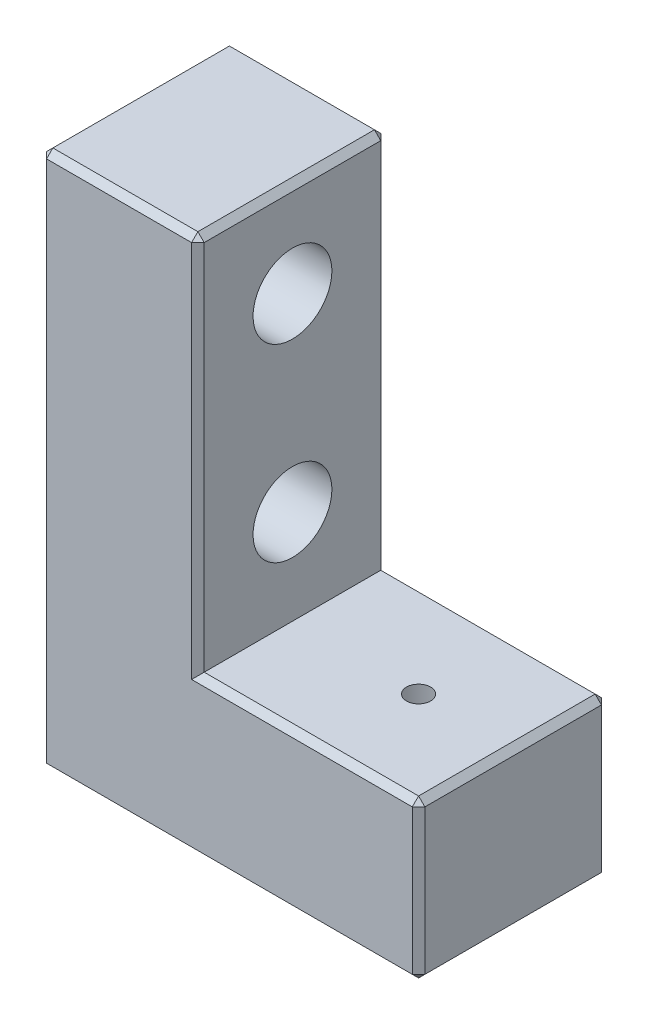
ISO-10303-21;
HEADER;
FILE_DESCRIPTION(('STEP AP214'),'2;1');
FILE_NAME('part.step','',(''),(''),'','','');
FILE_SCHEMA(('AUTOMOTIVE_DESIGN { 1 0 10303 214 1 1 1 1 }'));
ENDSEC;
DATA;
#1=APPLICATION_CONTEXT('core data for automotive mechanical design processes');
#2=APPLICATION_PROTOCOL_DEFINITION('international standard','automotive_design',2000,#1);
#3=PRODUCT_CONTEXT('',#1,'mechanical');
#4=PRODUCT('Part','Part','',(#3));
#5=PRODUCT_RELATED_PRODUCT_CATEGORY('part','',(#4));
#6=PRODUCT_DEFINITION_FORMATION('','',#4);
#7=PRODUCT_DEFINITION_CONTEXT('part definition',#1,'design');
#8=PRODUCT_DEFINITION('design','',#6,#7);
#9=PRODUCT_DEFINITION_SHAPE('','',#8);
#10=(LENGTH_UNIT() NAMED_UNIT(*) SI_UNIT(.MILLI.,.METRE.));
#11=(NAMED_UNIT(*) PLANE_ANGLE_UNIT() SI_UNIT($,.RADIAN.));
#12=(NAMED_UNIT(*) SI_UNIT($,.STERADIAN.) SOLID_ANGLE_UNIT());
#13=UNCERTAINTY_MEASURE_WITH_UNIT(LENGTH_MEASURE(1.E-05),#10,'distance_accuracy_value','');
#14=(GEOMETRIC_REPRESENTATION_CONTEXT(3) GLOBAL_UNCERTAINTY_ASSIGNED_CONTEXT((#13)) GLOBAL_UNIT_ASSIGNED_CONTEXT((#10,
#11,#12)) REPRESENTATION_CONTEXT('',''));
#15=CARTESIAN_POINT('',(0.,0.,0.));
#16=DIRECTION('',(0.,0.,1.));
#17=DIRECTION('',(1.,0.,0.));
#18=AXIS2_PLACEMENT_3D('',#15,#16,#17);
#19=CARTESIAN_POINT('',(5.,17.,3.));
#20=DIRECTION('',(0.,-1.,0.));
#21=DIRECTION('',(0.,0.,-1.));
#22=AXIS2_PLACEMENT_3D('',#19,#20,#21);
#23=PLANE('',#22);
#24=DIRECTION('',(0.,0.,-1.));
#25=VECTOR('',#24,1.);
#26=CARTESIAN_POINT('',(4.8,17.,3.));
#27=LINE('',#26,#25);
#28=CARTESIAN_POINT('',(4.8,17.,2.8));
#29=VERTEX_POINT('',#28);
#30=CARTESIAN_POINT('',(4.8,17.,-2.8));
#31=VERTEX_POINT('',#30);
#32=EDGE_CURVE('E210',#29,#31,#27,.T.);
#33=ORIENTED_EDGE('',*,*,#32,.T.);
#34=DIRECTION('',(-1.,0.,0.));
#35=VECTOR('',#34,1.);
#36=CARTESIAN_POINT('',(5.,17.,-2.8));
#37=LINE('',#36,#35);
#38=CARTESIAN_POINT('',(0.200000000000001,17.,-2.8));
#39=VERTEX_POINT('',#38);
#40=EDGE_CURVE('E213',#31,#39,#37,.T.);
#41=ORIENTED_EDGE('',*,*,#40,.T.);
#42=DIRECTION('',(0.,0.,1.));
#43=VECTOR('',#42,1.);
#44=CARTESIAN_POINT('',(0.200000000000001,17.,3.));
#45=LINE('',#44,#43);
#46=CARTESIAN_POINT('',(0.200000000000001,17.,2.8));
#47=VERTEX_POINT('',#46);
#48=EDGE_CURVE('E208',#39,#47,#45,.T.);
#49=ORIENTED_EDGE('',*,*,#48,.T.);
#50=DIRECTION('',(1.,0.,0.));
#51=VECTOR('',#50,1.);
#52=CARTESIAN_POINT('',(5.,17.,2.8));
#53=LINE('',#52,#51);
#54=EDGE_CURVE('E204',#47,#29,#53,.T.);
#55=ORIENTED_EDGE('',*,*,#54,.T.);
#56=EDGE_LOOP('',(#33,#41,#49,#55));
#57=FACE_BOUND('',#56,.T.);
#58=ADVANCED_FACE('F38',(#57),#23,.F.);
#59=CARTESIAN_POINT('',(0.,17.,3.));
#60=DIRECTION('',(1.,0.,0.));
#61=DIRECTION('',(0.,1.,0.));
#62=AXIS2_PLACEMENT_3D('',#59,#60,#61);
#63=PLANE('',#62);
#64=CARTESIAN_POINT('',(0.,8.,0.));
#65=DIRECTION('',(1.,0.,0.));
#66=DIRECTION('',(0.,1.,0.));
#67=AXIS2_PLACEMENT_3D('',#64,#65,#66);
#68=CIRCLE('',#67,1.25);
#69=CARTESIAN_POINT('',(0.,9.25,0.));
#70=VERTEX_POINT('',#69);
#71=EDGE_CURVE('E192',#70,#70,#68,.T.);
#72=ORIENTED_EDGE('',*,*,#71,.T.);
#73=EDGE_LOOP('',(#72));
#74=FACE_BOUND('',#73,.T.);
#75=CARTESIAN_POINT('',(0.,14.,0.));
#76=DIRECTION('',(1.,0.,0.));
#77=DIRECTION('',(0.,1.,0.));
#78=AXIS2_PLACEMENT_3D('',#75,#76,#77);
#79=CIRCLE('',#78,1.25);
#80=CARTESIAN_POINT('',(0.,15.25,0.));
#81=VERTEX_POINT('',#80);
#82=EDGE_CURVE('E198',#81,#81,#79,.T.);
#83=ORIENTED_EDGE('',*,*,#82,.T.);
#84=EDGE_LOOP('',(#83));
#85=FACE_BOUND('',#84,.T.);
#86=DIRECTION('',(0.,-1.,0.));
#87=VECTOR('',#86,1.);
#88=CARTESIAN_POINT('',(0.,17.,-2.8));
#89=LINE('',#88,#87);
#90=CARTESIAN_POINT('',(0.,16.8,-2.8));
#91=VERTEX_POINT('',#90);
#92=CARTESIAN_POINT('',(0.,0.199999999999999,-2.8));
#93=VERTEX_POINT('',#92);
#94=EDGE_CURVE('E227',#91,#93,#89,.T.);
#95=ORIENTED_EDGE('',*,*,#94,.T.);
#96=DIRECTION('',(0.,0.,1.));
#97=VECTOR('',#96,1.);
#98=CARTESIAN_POINT('',(0.,0.199999999999999,3.));
#99=LINE('',#98,#97);
#100=CARTESIAN_POINT('',(0.,0.200000000000003,2.8));
#101=VERTEX_POINT('',#100);
#102=EDGE_CURVE('E60',#93,#101,#99,.T.);
#103=ORIENTED_EDGE('',*,*,#102,.T.);
#104=DIRECTION('',(0.,1.,0.));
#105=VECTOR('',#104,1.);
#106=CARTESIAN_POINT('',(0.,17.,2.8));
#107=LINE('',#106,#105);
#108=CARTESIAN_POINT('',(0.,16.8,2.8));
#109=VERTEX_POINT('',#108);
#110=EDGE_CURVE('E222',#101,#109,#107,.T.);
#111=ORIENTED_EDGE('',*,*,#110,.T.);
#112=DIRECTION('',(0.,0.,-1.));
#113=VECTOR('',#112,1.);
#114=CARTESIAN_POINT('',(0.,16.8,3.));
#115=LINE('',#114,#113);
#116=EDGE_CURVE('E224',#109,#91,#115,.T.);
#117=ORIENTED_EDGE('',*,*,#116,.T.);
#118=EDGE_LOOP('',(#95,#103,#111,#117));
#119=FACE_BOUND('',#118,.T.);
#120=ADVANCED_FACE('F368',(#74,#85,#119),#63,.F.);
#121=CARTESIAN_POINT('',(0.,0.,3.));
#122=DIRECTION('',(0.,1.,0.));
#123=DIRECTION('',(0.,0.,1.));
#124=AXIS2_PLACEMENT_3D('',#121,#122,#123);
#125=PLANE('',#124);
#126=CARTESIAN_POINT('',(3.,0.,0.));
#127=DIRECTION('',(0.,-1.,0.));
#128=DIRECTION('',(0.,0.,-1.));
#129=AXIS2_PLACEMENT_3D('',#126,#127,#128);
#130=CIRCLE('',#129,1.25);
#131=CARTESIAN_POINT('',(3.,0.,-1.25));
#132=VERTEX_POINT('',#131);
#133=EDGE_CURVE('E183',#132,#132,#130,.T.);
#134=ORIENTED_EDGE('',*,*,#133,.F.);
#135=EDGE_LOOP('',(#134));
#136=FACE_BOUND('',#135,.T.);
#137=CARTESIAN_POINT('',(9.,0.,0.));
#138=DIRECTION('',(0.,-1.,0.));
#139=DIRECTION('',(0.,0.,-1.));
#140=AXIS2_PLACEMENT_3D('',#137,#138,#139);
#141=CIRCLE('',#140,1.25);
#142=CARTESIAN_POINT('',(9.,0.,-1.25));
#143=VERTEX_POINT('',#142);
#144=EDGE_CURVE('E186',#143,#143,#141,.T.);
#145=ORIENTED_EDGE('',*,*,#144,.F.);
#146=EDGE_LOOP('',(#145));
#147=FACE_BOUND('',#146,.T.);
#148=DIRECTION('',(-1.,0.,0.));
#149=VECTOR('',#148,1.);
#150=CARTESIAN_POINT('',(0.,0.,2.8));
#151=LINE('',#150,#149);
#152=CARTESIAN_POINT('',(11.8,0.,2.8));
#153=VERTEX_POINT('',#152);
#154=CARTESIAN_POINT('',(0.200000000000001,0.,2.8));
#155=VERTEX_POINT('',#154);
#156=EDGE_CURVE('E238',#153,#155,#151,.T.);
#157=ORIENTED_EDGE('',*,*,#156,.T.);
#158=DIRECTION('',(0.,0.,-1.));
#159=VECTOR('',#158,1.);
#160=CARTESIAN_POINT('',(0.200000000000001,0.,3.));
#161=LINE('',#160,#159);
#162=CARTESIAN_POINT('',(0.2,0.,-2.8));
#163=VERTEX_POINT('',#162);
#164=EDGE_CURVE('E278',#155,#163,#161,.T.);
#165=ORIENTED_EDGE('',*,*,#164,.T.);
#166=DIRECTION('',(1.,0.,0.));
#167=VECTOR('',#166,1.);
#168=CARTESIAN_POINT('',(0.,0.,-2.8));
#169=LINE('',#168,#167);
#170=CARTESIAN_POINT('',(11.8,0.,-2.8));
#171=VERTEX_POINT('',#170);
#172=EDGE_CURVE('E243',#163,#171,#169,.T.);
#173=ORIENTED_EDGE('',*,*,#172,.T.);
#174=DIRECTION('',(0.,0.,1.));
#175=VECTOR('',#174,1.);
#176=CARTESIAN_POINT('',(11.8,0.,3.));
#177=LINE('',#176,#175);
#178=EDGE_CURVE('E241',#171,#153,#177,.T.);
#179=ORIENTED_EDGE('',*,*,#178,.T.);
#180=EDGE_LOOP('',(#157,#165,#173,#179));
#181=FACE_BOUND('',#180,.T.);
#182=ADVANCED_FACE('F377',(#136,#147,#181),#125,.F.);
#183=CARTESIAN_POINT('',(12.,0.,3.));
#184=DIRECTION('',(-1.,0.,0.));
#185=DIRECTION('',(0.,0.,1.));
#186=AXIS2_PLACEMENT_3D('',#183,#184,#185);
#187=PLANE('',#186);
#188=DIRECTION('',(0.,-1.,0.));
#189=VECTOR('',#188,1.);
#190=CARTESIAN_POINT('',(12.,0.,2.8));
#191=LINE('',#190,#189);
#192=CARTESIAN_POINT('',(12.,4.8,2.8));
#193=VERTEX_POINT('',#192);
#194=CARTESIAN_POINT('',(12.,0.199999999999999,2.8));
#195=VERTEX_POINT('',#194);
#196=EDGE_CURVE('E229',#193,#195,#191,.T.);
#197=ORIENTED_EDGE('',*,*,#196,.T.);
#198=DIRECTION('',(0.,0.,-1.));
#199=VECTOR('',#198,1.);
#200=CARTESIAN_POINT('',(12.,0.199999999999999,3.));
#201=LINE('',#200,#199);
#202=CARTESIAN_POINT('',(12.,0.199999999999999,-2.8));
#203=VERTEX_POINT('',#202);
#204=EDGE_CURVE('E235',#195,#203,#201,.T.);
#205=ORIENTED_EDGE('',*,*,#204,.T.);
#206=DIRECTION('',(0.,1.,0.));
#207=VECTOR('',#206,1.);
#208=CARTESIAN_POINT('',(12.,0.,-2.8));
#209=LINE('',#208,#207);
#210=CARTESIAN_POINT('',(12.,4.8,-2.8));
#211=VERTEX_POINT('',#210);
#212=EDGE_CURVE('E233',#203,#211,#209,.T.);
#213=ORIENTED_EDGE('',*,*,#212,.T.);
#214=DIRECTION('',(0.,0.,1.));
#215=VECTOR('',#214,1.);
#216=CARTESIAN_POINT('',(12.,4.8,3.));
#217=LINE('',#216,#215);
#218=EDGE_CURVE('E231',#211,#193,#217,.T.);
#219=ORIENTED_EDGE('',*,*,#218,.T.);
#220=EDGE_LOOP('',(#197,#205,#213,#219));
#221=FACE_BOUND('',#220,.T.);
#222=ADVANCED_FACE('F448',(#221),#187,.F.);
#223=CARTESIAN_POINT('',(12.,5.,3.));
#224=DIRECTION('',(0.,-1.,0.));
#225=DIRECTION('',(1.,0.,0.));
#226=AXIS2_PLACEMENT_3D('',#223,#224,#225);
#227=PLANE('',#226);
#228=CARTESIAN_POINT('',(9.,5.,0.));
#229=DIRECTION('',(0.,-1.,0.));
#230=DIRECTION('',(1.,0.,0.));
#231=AXIS2_PLACEMENT_3D('',#228,#229,#230);
#232=CIRCLE('',#231,0.383974596215563);
#233=CARTESIAN_POINT('',(9.38397459621556,5.,0.));
#234=VERTEX_POINT('',#233);
#235=EDGE_CURVE('E177',#234,#234,#232,.T.);
#236=ORIENTED_EDGE('',*,*,#235,.T.);
#237=EDGE_LOOP('',(#236));
#238=FACE_BOUND('',#237,.T.);
#239=DIRECTION('',(0.,0.,-1.));
#240=VECTOR('',#239,1.);
#241=CARTESIAN_POINT('',(11.8,5.,3.));
#242=LINE('',#241,#240);
#243=CARTESIAN_POINT('',(11.8,5.,2.8));
#244=VERTEX_POINT('',#243);
#245=CARTESIAN_POINT('',(11.8,5.,-2.8));
#246=VERTEX_POINT('',#245);
#247=EDGE_CURVE('E260',#244,#246,#242,.T.);
#248=ORIENTED_EDGE('',*,*,#247,.T.);
#249=DIRECTION('',(-1.,0.,0.));
#250=VECTOR('',#249,1.);
#251=CARTESIAN_POINT('',(12.,5.,-2.8));
#252=LINE('',#251,#250);
#253=CARTESIAN_POINT('',(5.,5.,-2.8));
#254=VERTEX_POINT('',#253);
#255=EDGE_CURVE('E262',#246,#254,#252,.T.);
#256=ORIENTED_EDGE('',*,*,#255,.T.);
#257=DIRECTION('',(0.,0.,-1.));
#258=VECTOR('',#257,1.);
#259=CARTESIAN_POINT('',(5.,5.,3.));
#260=LINE('',#259,#258);
#261=CARTESIAN_POINT('',(5.,5.,2.8));
#262=VERTEX_POINT('',#261);
#263=EDGE_CURVE('E201',#262,#254,#260,.T.);
#264=ORIENTED_EDGE('',*,*,#263,.F.);
#265=DIRECTION('',(1.,0.,0.));
#266=VECTOR('',#265,1.);
#267=CARTESIAN_POINT('',(12.,5.,2.8));
#268=LINE('',#267,#266);
#269=EDGE_CURVE('E258',#262,#244,#268,.T.);
#270=ORIENTED_EDGE('',*,*,#269,.T.);
#271=EDGE_LOOP('',(#248,#256,#264,#270));
#272=FACE_BOUND('',#271,.T.);
#273=ADVANCED_FACE('F492',(#238,#272),#227,.F.);
#274=CARTESIAN_POINT('',(5.,5.,3.));
#275=DIRECTION('',(-1.,0.,0.));
#276=DIRECTION('',(0.,0.,1.));
#277=AXIS2_PLACEMENT_3D('',#274,#275,#276);
#278=PLANE('',#277);
#279=CARTESIAN_POINT('',(5.,8.,0.));
#280=DIRECTION('',(1.,0.,0.));
#281=DIRECTION('',(0.,1.,0.));
#282=AXIS2_PLACEMENT_3D('',#279,#280,#281);
#283=CIRCLE('',#282,1.25);
#284=CARTESIAN_POINT('',(5.,9.25,0.));
#285=VERTEX_POINT('',#284);
#286=EDGE_CURVE('E189',#285,#285,#283,.T.);
#287=ORIENTED_EDGE('',*,*,#286,.F.);
#288=EDGE_LOOP('',(#287));
#289=FACE_BOUND('',#288,.T.);
#290=CARTESIAN_POINT('',(5.,14.,0.));
#291=DIRECTION('',(1.,0.,0.));
#292=DIRECTION('',(0.,1.,0.));
#293=AXIS2_PLACEMENT_3D('',#290,#291,#292);
#294=CIRCLE('',#293,1.25);
#295=CARTESIAN_POINT('',(5.,15.25,0.));
#296=VERTEX_POINT('',#295);
#297=EDGE_CURVE('E195',#296,#296,#294,.T.);
#298=ORIENTED_EDGE('',*,*,#297,.F.);
#299=EDGE_LOOP('',(#298));
#300=FACE_BOUND('',#299,.T.);
#301=ORIENTED_EDGE('',*,*,#263,.T.);
#302=DIRECTION('',(0.,1.,0.));
#303=VECTOR('',#302,1.);
#304=CARTESIAN_POINT('',(5.,5.,-2.8));
#305=LINE('',#304,#303);
#306=CARTESIAN_POINT('',(5.,16.8,-2.8));
#307=VERTEX_POINT('',#306);
#308=EDGE_CURVE('E220',#254,#307,#305,.T.);
#309=ORIENTED_EDGE('',*,*,#308,.T.);
#310=DIRECTION('',(0.,0.,1.));
#311=VECTOR('',#310,1.);
#312=CARTESIAN_POINT('',(5.,16.8,3.));
#313=LINE('',#312,#311);
#314=CARTESIAN_POINT('',(5.,16.8,2.8));
#315=VERTEX_POINT('',#314);
#316=EDGE_CURVE('E217',#307,#315,#313,.T.);
#317=ORIENTED_EDGE('',*,*,#316,.T.);
#318=DIRECTION('',(0.,-1.,0.));
#319=VECTOR('',#318,1.);
#320=CARTESIAN_POINT('',(5.,5.,2.8));
#321=LINE('',#320,#319);
#322=EDGE_CURVE('E215',#315,#262,#321,.T.);
#323=ORIENTED_EDGE('',*,*,#322,.T.);
#324=EDGE_LOOP('',(#301,#309,#317,#323));
#325=FACE_BOUND('',#324,.T.);
#326=ADVANCED_FACE('F495',(#289,#300,#325),#278,.F.);
#327=CARTESIAN_POINT('',(0.,0.,3.));
#328=DIRECTION('',(0.,0.,1.));
#329=DIRECTION('',(1.,0.,0.));
#330=AXIS2_PLACEMENT_3D('',#327,#328,#329);
#331=PLANE('',#330);
#332=DIRECTION('',(-1.,0.,0.));
#333=VECTOR('',#332,1.);
#334=CARTESIAN_POINT('',(5.,4.8,3.));
#335=LINE('',#334,#333);
#336=CARTESIAN_POINT('',(11.8,4.8,3.));
#337=VERTEX_POINT('',#336);
#338=CARTESIAN_POINT('',(4.8,4.8,3.));
#339=VERTEX_POINT('',#338);
#340=EDGE_CURVE('E273',#337,#339,#335,.T.);
#341=ORIENTED_EDGE('',*,*,#340,.T.);
#342=DIRECTION('',(0.,1.,0.));
#343=VECTOR('',#342,1.);
#344=CARTESIAN_POINT('',(4.8,17.,3.));
#345=LINE('',#344,#343);
#346=CARTESIAN_POINT('',(4.8,16.8,3.));
#347=VERTEX_POINT('',#346);
#348=EDGE_CURVE('E275',#339,#347,#345,.T.);
#349=ORIENTED_EDGE('',*,*,#348,.T.);
#350=DIRECTION('',(-1.,0.,0.));
#351=VECTOR('',#350,1.);
#352=CARTESIAN_POINT('',(0.,16.8,3.));
#353=LINE('',#352,#351);
#354=CARTESIAN_POINT('',(0.199999999999999,16.8,3.));
#355=VERTEX_POINT('',#354);
#356=EDGE_CURVE('E264',#347,#355,#353,.T.);
#357=ORIENTED_EDGE('',*,*,#356,.T.);
#358=DIRECTION('',(0.,-1.,0.));
#359=VECTOR('',#358,1.);
#360=CARTESIAN_POINT('',(0.199999999999999,0.,3.));
#361=LINE('',#360,#359);
#362=CARTESIAN_POINT('',(0.199999999999999,0.199999999999999,3.));
#363=VERTEX_POINT('',#362);
#364=EDGE_CURVE('E266',#355,#363,#361,.T.);
#365=ORIENTED_EDGE('',*,*,#364,.T.);
#366=DIRECTION('',(1.,0.,0.));
#367=VECTOR('',#366,1.);
#368=CARTESIAN_POINT('',(12.,0.199999999999999,3.));
#369=LINE('',#368,#367);
#370=CARTESIAN_POINT('',(11.8,0.199999999999999,3.));
#371=VERTEX_POINT('',#370);
#372=EDGE_CURVE('E269',#363,#371,#369,.T.);
#373=ORIENTED_EDGE('',*,*,#372,.T.);
#374=DIRECTION('',(0.,1.,0.));
#375=VECTOR('',#374,1.);
#376=CARTESIAN_POINT('',(11.8,5.,3.));
#377=LINE('',#376,#375);
#378=EDGE_CURVE('E271',#371,#337,#377,.T.);
#379=ORIENTED_EDGE('',*,*,#378,.T.);
#380=EDGE_LOOP('',(#341,#349,#357,#365,#373,#379));
#381=FACE_BOUND('',#380,.T.);
#382=ADVANCED_FACE('F390',(#381),#331,.T.);
#383=CARTESIAN_POINT('',(0.,0.,-3.));
#384=DIRECTION('',(0.,0.,1.));
#385=DIRECTION('',(1.,0.,0.));
#386=AXIS2_PLACEMENT_3D('',#383,#384,#385);
#387=PLANE('',#386);
#388=DIRECTION('',(-1.,0.,0.));
#389=VECTOR('',#388,1.);
#390=CARTESIAN_POINT('',(0.,0.200000000000001,-3.));
#391=LINE('',#390,#389);
#392=CARTESIAN_POINT('',(11.8,0.200000000000001,-3.));
#393=VERTEX_POINT('',#392);
#394=CARTESIAN_POINT('',(0.200000000000001,0.200000000000001,-3.));
#395=VERTEX_POINT('',#394);
#396=EDGE_CURVE('E253',#393,#395,#391,.T.);
#397=ORIENTED_EDGE('',*,*,#396,.T.);
#398=DIRECTION('',(0.,1.,0.));
#399=VECTOR('',#398,1.);
#400=CARTESIAN_POINT('',(0.200000000000001,0.,-3.));
#401=LINE('',#400,#399);
#402=CARTESIAN_POINT('',(0.200000000000001,16.8,-3.));
#403=VERTEX_POINT('',#402);
#404=EDGE_CURVE('E255',#395,#403,#401,.T.);
#405=ORIENTED_EDGE('',*,*,#404,.T.);
#406=DIRECTION('',(1.,0.,0.));
#407=VECTOR('',#406,1.);
#408=CARTESIAN_POINT('',(0.,16.8,-3.));
#409=LINE('',#408,#407);
#410=CARTESIAN_POINT('',(4.8,16.8,-3.));
#411=VERTEX_POINT('',#410);
#412=EDGE_CURVE('E249',#403,#411,#409,.T.);
#413=ORIENTED_EDGE('',*,*,#412,.T.);
#414=DIRECTION('',(0.,-1.,0.));
#415=VECTOR('',#414,1.);
#416=CARTESIAN_POINT('',(4.8,0.,-3.));
#417=LINE('',#416,#415);
#418=CARTESIAN_POINT('',(4.8,4.8,-3.));
#419=VERTEX_POINT('',#418);
#420=EDGE_CURVE('E247',#411,#419,#417,.T.);
#421=ORIENTED_EDGE('',*,*,#420,.T.);
#422=DIRECTION('',(1.,0.,0.));
#423=VECTOR('',#422,1.);
#424=CARTESIAN_POINT('',(0.,4.8,-3.));
#425=LINE('',#424,#423);
#426=CARTESIAN_POINT('',(11.8,4.8,-3.));
#427=VERTEX_POINT('',#426);
#428=EDGE_CURVE('E245',#419,#427,#425,.T.);
#429=ORIENTED_EDGE('',*,*,#428,.T.);
#430=DIRECTION('',(0.,-1.,0.));
#431=VECTOR('',#430,1.);
#432=CARTESIAN_POINT('',(11.8,0.,-3.));
#433=LINE('',#432,#431);
#434=EDGE_CURVE('E251',#427,#393,#433,.T.);
#435=ORIENTED_EDGE('',*,*,#434,.T.);
#436=EDGE_LOOP('',(#397,#405,#413,#421,#429,#435));
#437=FACE_BOUND('',#436,.T.);
#438=ADVANCED_FACE('F420',(#437),#387,.F.);
#439=CARTESIAN_POINT('',(-0.999999999999998,14.,0.));
#440=DIRECTION('',(1.,0.,0.));
#441=DIRECTION('',(0.,1.,0.));
#442=AXIS2_PLACEMENT_3D('',#439,#440,#441);
#443=CYLINDRICAL_SURFACE('',#442,1.25);
#444=ORIENTED_EDGE('',*,*,#297,.T.);
#445=EDGE_LOOP('',(#444));
#446=FACE_BOUND('',#445,.T.);
#447=ORIENTED_EDGE('',*,*,#82,.F.);
#448=EDGE_LOOP('',(#447));
#449=FACE_BOUND('',#448,.T.);
#450=ADVANCED_FACE('F502',(#446,#449),#443,.F.);
#451=CARTESIAN_POINT('',(-0.999999999999998,8.,0.));
#452=DIRECTION('',(1.,0.,0.));
#453=DIRECTION('',(0.,1.,0.));
#454=AXIS2_PLACEMENT_3D('',#451,#452,#453);
#455=CYLINDRICAL_SURFACE('',#454,1.25);
#456=ORIENTED_EDGE('',*,*,#286,.T.);
#457=EDGE_LOOP('',(#456));
#458=FACE_BOUND('',#457,.T.);
#459=ORIENTED_EDGE('',*,*,#71,.F.);
#460=EDGE_LOOP('',(#459));
#461=FACE_BOUND('',#460,.T.);
#462=ADVANCED_FACE('F507',(#458,#461),#455,.F.);
#463=CARTESIAN_POINT('',(9.,3.,0.));
#464=DIRECTION('',(0.,-1.,0.));
#465=DIRECTION('',(0.,0.,-1.));
#466=AXIS2_PLACEMENT_3D('',#463,#464,#465);
#467=CYLINDRICAL_SURFACE('',#466,1.25);
#468=ORIENTED_EDGE('',*,*,#144,.T.);
#469=EDGE_LOOP('',(#468));
#470=FACE_BOUND('',#469,.T.);
#471=CARTESIAN_POINT('',(9.,4.5,0.));
#472=DIRECTION('',(0.,-1.,0.));
#473=DIRECTION('',(0.,0.,-1.));
#474=AXIS2_PLACEMENT_3D('',#471,#472,#473);
#475=CIRCLE('',#474,1.25);
#476=CARTESIAN_POINT('',(9.,4.5,-1.25));
#477=VERTEX_POINT('',#476);
#478=EDGE_CURVE('E173',#477,#477,#475,.T.);
#479=ORIENTED_EDGE('',*,*,#478,.F.);
#480=EDGE_LOOP('',(#479));
#481=FACE_BOUND('',#480,.T.);
#482=ADVANCED_FACE('F511',(#470,#481),#467,.F.);
#483=CARTESIAN_POINT('',(3.,3.,0.));
#484=DIRECTION('',(0.,-1.,0.));
#485=DIRECTION('',(0.,0.,-1.));
#486=AXIS2_PLACEMENT_3D('',#483,#484,#485);
#487=CYLINDRICAL_SURFACE('',#486,1.25);
#488=ORIENTED_EDGE('',*,*,#133,.T.);
#489=EDGE_LOOP('',(#488));
#490=FACE_BOUND('',#489,.T.);
#491=CARTESIAN_POINT('',(3.,4.5,0.));
#492=DIRECTION('',(0.,-1.,0.));
#493=DIRECTION('',(0.,0.,-1.));
#494=AXIS2_PLACEMENT_3D('',#491,#492,#493);
#495=CIRCLE('',#494,1.25);
#496=CARTESIAN_POINT('',(3.,4.5,-1.25));
#497=VERTEX_POINT('',#496);
#498=EDGE_CURVE('E171',#497,#497,#495,.T.);
#499=ORIENTED_EDGE('',*,*,#498,.F.);
#500=EDGE_LOOP('',(#499));
#501=FACE_BOUND('',#500,.T.);
#502=ADVANCED_FACE('F515',(#490,#501),#487,.F.);
#503=CARTESIAN_POINT('',(9.,4.5,0.));
#504=DIRECTION('',(0.,-1.,0.));
#505=DIRECTION('',(0.,0.,-1.));
#506=AXIS2_PLACEMENT_3D('',#503,#504,#505);
#507=CONICAL_SURFACE('',#506,1.25,1.0471975511966);
#508=ORIENTED_EDGE('',*,*,#478,.T.);
#509=EDGE_LOOP('',(#508));
#510=FACE_BOUND('',#509,.T.);
#511=ORIENTED_EDGE('',*,*,#235,.F.);
#512=EDGE_LOOP('',(#511));
#513=FACE_BOUND('',#512,.T.);
#514=ADVANCED_FACE('F167',(#510,#513),#507,.F.);
#515=CARTESIAN_POINT('',(3.,4.5,0.));
#516=DIRECTION('',(0.,-1.,0.));
#517=DIRECTION('',(0.,0.,-1.));
#518=AXIS2_PLACEMENT_3D('',#515,#516,#517);
#519=CONICAL_SURFACE('',#518,1.25,1.0471975511966);
#520=CARTESIAN_POINT('',(3.,5.22168783648703,0.));
#521=VERTEX_POINT('',#520);
#522=VERTEX_LOOP('',#521);
#523=FACE_BOUND('',#522,.T.);
#524=ORIENTED_EDGE('',*,*,#498,.T.);
#525=EDGE_LOOP('',(#524));
#526=FACE_BOUND('',#525,.T.);
#527=ADVANCED_FACE('F163',(#523,#526),#519,.F.);
#528=CARTESIAN_POINT('',(12.,0.199999999999999,3.));
#529=DIRECTION('',(-0.707106781186544,0.707106781186551,0.));
#530=DIRECTION('',(0.,0.,-1.));
#531=AXIS2_PLACEMENT_3D('',#528,#529,#530);
#532=PLANE('',#531);
#533=DIRECTION('',(-0.707106781186551,-0.707106781186544,0.));
#534=VECTOR('',#533,1.);
#535=CARTESIAN_POINT('',(11.8,0.,2.8));
#536=LINE('',#535,#534);
#537=EDGE_CURVE('E174',#153,#195,#536,.F.);
#538=ORIENTED_EDGE('',*,*,#537,.F.);
#539=ORIENTED_EDGE('',*,*,#178,.F.);
#540=DIRECTION('',(0.707106781186551,0.707106781186544,0.));
#541=VECTOR('',#540,1.);
#542=CARTESIAN_POINT('',(12.,0.199999999999999,-2.8));
#543=LINE('',#542,#541);
#544=EDGE_CURVE('E180',#203,#171,#543,.F.);
#545=ORIENTED_EDGE('',*,*,#544,.F.);
#546=ORIENTED_EDGE('',*,*,#204,.F.);
#547=EDGE_LOOP('',(#538,#539,#545,#546));
#548=FACE_BOUND('',#547,.T.);
#549=ADVANCED_FACE('F166',(#548),#532,.F.);
#550=CARTESIAN_POINT('',(11.8,0.,2.8));
#551=DIRECTION('',(0.577350269189626,-0.577350269189631,0.577350269189621));
#552=DIRECTION('',(0.70710678118655,0.707106781186544,0.));
#553=AXIS2_PLACEMENT_3D('',#550,#551,#552);
#554=PLANE('',#553);
#555=DIRECTION('',(0.,-0.707106781186544,-0.707106781186551));
#556=VECTOR('',#555,1.);
#557=CARTESIAN_POINT('',(11.8,0.,2.8));
#558=LINE('',#557,#556);
#559=EDGE_CURVE('E346',#153,#371,#558,.F.);
#560=ORIENTED_EDGE('',*,*,#559,.F.);
#561=ORIENTED_EDGE('',*,*,#537,.T.);
#562=DIRECTION('',(-0.707106781186544,0.,0.707106781186551));
#563=VECTOR('',#562,1.);
#564=CARTESIAN_POINT('',(11.9,0.199999999999999,2.9));
#565=LINE('',#564,#563);
#566=EDGE_CURVE('E349',#371,#195,#565,.F.);
#567=ORIENTED_EDGE('',*,*,#566,.F.);
#568=EDGE_LOOP('',(#560,#561,#567));
#569=FACE_BOUND('',#568,.T.);
#570=ADVANCED_FACE('F387',(#569),#554,.T.);
#571=CARTESIAN_POINT('',(12.,0.199999999999999,-2.8));
#572=DIRECTION('',(0.577350269189621,-0.577350269189626,-0.577350269189631));
#573=DIRECTION('',(0.,0.70710678118655,-0.707106781186544));
#574=AXIS2_PLACEMENT_3D('',#571,#572,#573);
#575=PLANE('',#574);
#576=DIRECTION('',(-0.707106781186551,0.,-0.707106781186544));
#577=VECTOR('',#576,1.);
#578=CARTESIAN_POINT('',(12.,0.199999999999999,-2.8));
#579=LINE('',#578,#577);
#580=EDGE_CURVE('E340',#203,#393,#579,.T.);
#581=ORIENTED_EDGE('',*,*,#580,.F.);
#582=ORIENTED_EDGE('',*,*,#544,.T.);
#583=DIRECTION('',(0.,-0.707106781186551,0.707106781186545));
#584=VECTOR('',#583,1.);
#585=CARTESIAN_POINT('',(11.8,0.1,-2.9));
#586=LINE('',#585,#584);
#587=EDGE_CURVE('E343',#393,#171,#586,.T.);
#588=ORIENTED_EDGE('',*,*,#587,.F.);
#589=EDGE_LOOP('',(#581,#582,#588));
#590=FACE_BOUND('',#589,.T.);
#591=ADVANCED_FACE('F550',(#590),#575,.T.);
#592=CARTESIAN_POINT('',(11.8,0.,3.));
#593=DIRECTION('',(0.707106781186551,0.,0.707106781186544));
#594=DIRECTION('',(0.,-1.,0.));
#595=AXIS2_PLACEMENT_3D('',#592,#593,#594);
#596=PLANE('',#595);
#597=ORIENTED_EDGE('',*,*,#566,.T.);
#598=ORIENTED_EDGE('',*,*,#196,.F.);
#599=DIRECTION('',(0.707106781186544,0.,-0.70710678118655));
#600=VECTOR('',#599,1.);
#601=CARTESIAN_POINT('',(12.,4.8,2.8));
#602=LINE('',#601,#600);
#603=EDGE_CURVE('E334',#337,#193,#602,.T.);
#604=ORIENTED_EDGE('',*,*,#603,.F.);
#605=ORIENTED_EDGE('',*,*,#378,.F.);
#606=EDGE_LOOP('',(#597,#598,#604,#605));
#607=FACE_BOUND('',#606,.T.);
#608=ADVANCED_FACE('F450',(#607),#596,.T.);
#609=CARTESIAN_POINT('',(0.,0.199999999999999,3.));
#610=DIRECTION('',(0.,-0.707106781186551,0.707106781186544));
#611=DIRECTION('',(-1.,0.,0.));
#612=AXIS2_PLACEMENT_3D('',#609,#610,#611);
#613=PLANE('',#612);
#614=DIRECTION('',(0.577350269189624,0.577350269189624,0.577350269189629));
#615=VECTOR('',#614,1.);
#616=CARTESIAN_POINT('',(0.133333333333333,0.133333333333333,2.93333333333333));
#617=LINE('',#616,#615);
#618=CARTESIAN_POINT('',(0.0999999999999998,0.0999999999999998,2.9));
#619=VERTEX_POINT('',#618);
#620=EDGE_CURVE('E332',#619,#363,#617,.T.);
#621=ORIENTED_EDGE('',*,*,#620,.F.);
#622=DIRECTION('',(-0.577350269189627,0.577350269189622,0.577350269189627));
#623=VECTOR('',#622,1.);
#624=CARTESIAN_POINT('',(0.,0.199999999999999,3.));
#625=LINE('',#624,#623);
#626=EDGE_CURVE('E11',#619,#155,#625,.F.);
#627=ORIENTED_EDGE('',*,*,#626,.T.);
#628=ORIENTED_EDGE('',*,*,#156,.F.);
#629=ORIENTED_EDGE('',*,*,#559,.T.);
#630=ORIENTED_EDGE('',*,*,#372,.F.);
#631=EDGE_LOOP('',(#621,#627,#628,#629,#630));
#632=FACE_BOUND('',#631,.T.);
#633=ADVANCED_FACE('F374',(#632),#613,.T.);
#634=CARTESIAN_POINT('',(0.,0.,-2.8));
#635=DIRECTION('',(0.,0.707106781186544,0.707106781186551));
#636=DIRECTION('',(1.,0.,0.));
#637=AXIS2_PLACEMENT_3D('',#634,#635,#636);
#638=PLANE('',#637);
#639=ORIENTED_EDGE('',*,*,#172,.F.);
#640=DIRECTION('',(-0.577350269189631,0.577350269189626,-0.577350269189621));
#641=VECTOR('',#640,1.);
#642=CARTESIAN_POINT('',(0.133333333333333,0.0666666666666674,-2.86666666666667));
#643=LINE('',#642,#641);
#644=CARTESIAN_POINT('',(0.0999999999999989,0.0999999999999997,-2.9));
#645=VERTEX_POINT('',#644);
#646=EDGE_CURVE('E356',#163,#645,#643,.T.);
#647=ORIENTED_EDGE('',*,*,#646,.T.);
#648=DIRECTION('',(0.577350269189627,0.577350269189627,-0.577350269189622));
#649=VECTOR('',#648,1.);
#650=CARTESIAN_POINT('',(0.,0.,-2.8));
#651=LINE('',#650,#649);
#652=EDGE_CURVE('E329',#395,#645,#651,.F.);
#653=ORIENTED_EDGE('',*,*,#652,.F.);
#654=ORIENTED_EDGE('',*,*,#396,.F.);
#655=ORIENTED_EDGE('',*,*,#587,.T.);
#656=EDGE_LOOP('',(#639,#647,#653,#654,#655));
#657=FACE_BOUND('',#656,.T.);
#658=ADVANCED_FACE('F571',(#657),#638,.F.);
#659=CARTESIAN_POINT('',(12.,0.,-2.8));
#660=DIRECTION('',(-0.707106781186544,0.,0.707106781186551));
#661=DIRECTION('',(0.,1.,0.));
#662=AXIS2_PLACEMENT_3D('',#659,#660,#661);
#663=PLANE('',#662);
#664=ORIENTED_EDGE('',*,*,#580,.T.);
#665=ORIENTED_EDGE('',*,*,#434,.F.);
#666=DIRECTION('',(0.707106781186551,0.,0.707106781186544));
#667=VECTOR('',#666,1.);
#668=CARTESIAN_POINT('',(12.,4.8,-2.8));
#669=LINE('',#668,#667);
#670=EDGE_CURVE('E326',#211,#427,#669,.F.);
#671=ORIENTED_EDGE('',*,*,#670,.F.);
#672=ORIENTED_EDGE('',*,*,#212,.F.);
#673=EDGE_LOOP('',(#664,#665,#671,#672));
#674=FACE_BOUND('',#673,.T.);
#675=ADVANCED_FACE('F435',(#674),#663,.F.);
#676=CARTESIAN_POINT('',(11.8,5.,3.));
#677=DIRECTION('',(-0.707106781186551,-0.707106781186544,0.));
#678=DIRECTION('',(0.,0.,-1.));
#679=AXIS2_PLACEMENT_3D('',#676,#677,#678);
#680=PLANE('',#679);
#681=DIRECTION('',(0.707106781186544,-0.707106781186551,0.));
#682=VECTOR('',#681,1.);
#683=CARTESIAN_POINT('',(12.,4.8,2.8));
#684=LINE('',#683,#682);
#685=EDGE_CURVE('E337',#193,#244,#684,.F.);
#686=ORIENTED_EDGE('',*,*,#685,.F.);
#687=ORIENTED_EDGE('',*,*,#218,.F.);
#688=DIRECTION('',(-0.707106781186544,0.707106781186551,0.));
#689=VECTOR('',#688,1.);
#690=CARTESIAN_POINT('',(12.,4.8,-2.8));
#691=LINE('',#690,#689);
#692=EDGE_CURVE('E323',#246,#211,#691,.F.);
#693=ORIENTED_EDGE('',*,*,#692,.F.);
#694=ORIENTED_EDGE('',*,*,#247,.F.);
#695=EDGE_LOOP('',(#686,#687,#693,#694));
#696=FACE_BOUND('',#695,.T.);
#697=ADVANCED_FACE('F445',(#696),#680,.F.);
#698=CARTESIAN_POINT('',(12.,4.8,2.8));
#699=DIRECTION('',(0.57735026918963,0.577350269189625,0.577350269189622));
#700=DIRECTION('',(-0.707106781186545,0.707106781186551,0.));
#701=AXIS2_PLACEMENT_3D('',#698,#699,#700);
#702=PLANE('',#701);
#703=ORIENTED_EDGE('',*,*,#603,.T.);
#704=ORIENTED_EDGE('',*,*,#685,.T.);
#705=DIRECTION('',(0.,-0.707106781186546,0.707106781186549));
#706=VECTOR('',#705,1.);
#707=CARTESIAN_POINT('',(11.8,4.9,2.9));
#708=LINE('',#707,#706);
#709=EDGE_CURVE('E320',#337,#244,#708,.F.);
#710=ORIENTED_EDGE('',*,*,#709,.F.);
#711=EDGE_LOOP('',(#703,#704,#710));
#712=FACE_BOUND('',#711,.T.);
#713=ADVANCED_FACE('F454',(#712),#702,.T.);
#714=CARTESIAN_POINT('',(0.199999999999999,0.,3.));
#715=DIRECTION('',(-0.707106781186551,0.,0.707106781186544));
#716=DIRECTION('',(0.,1.,0.));
#717=AXIS2_PLACEMENT_3D('',#714,#715,#716);
#718=PLANE('',#717);
#719=ORIENTED_EDGE('',*,*,#110,.F.);
#720=DIRECTION('',(-0.577350269189626,0.577350269189621,-0.577350269189631));
#721=VECTOR('',#720,1.);
#722=CARTESIAN_POINT('',(0.199999999999999,0.,3.));
#723=LINE('',#722,#721);
#724=EDGE_CURVE('E46',#101,#619,#723,.F.);
#725=ORIENTED_EDGE('',*,*,#724,.T.);
#726=ORIENTED_EDGE('',*,*,#620,.T.);
#727=ORIENTED_EDGE('',*,*,#364,.F.);
#728=DIRECTION('',(0.707106781186544,0.,0.707106781186551));
#729=VECTOR('',#728,1.);
#730=CARTESIAN_POINT('',(0.0999999999999994,16.8,2.9));
#731=LINE('',#730,#729);
#732=EDGE_CURVE('E317',#109,#355,#731,.T.);
#733=ORIENTED_EDGE('',*,*,#732,.F.);
#734=EDGE_LOOP('',(#719,#725,#726,#727,#733));
#735=FACE_BOUND('',#734,.T.);
#736=ADVANCED_FACE('F395',(#735),#718,.T.);
#737=CARTESIAN_POINT('',(0.,16.8,3.));
#738=DIRECTION('',(0.707106781186544,-0.707106781186551,0.));
#739=DIRECTION('',(0.,0.,-1.));
#740=AXIS2_PLACEMENT_3D('',#737,#738,#739);
#741=PLANE('',#740);
#742=DIRECTION('',(-0.707106781186551,-0.707106781186544,0.));
#743=VECTOR('',#742,1.);
#744=CARTESIAN_POINT('',(0.,16.8,-2.8));
#745=LINE('',#744,#743);
#746=EDGE_CURVE('E311',#91,#39,#745,.F.);
#747=ORIENTED_EDGE('',*,*,#746,.F.);
#748=ORIENTED_EDGE('',*,*,#116,.F.);
#749=DIRECTION('',(0.707106781186551,0.707106781186544,0.));
#750=VECTOR('',#749,1.);
#751=CARTESIAN_POINT('',(0.200000000000001,17.,2.8));
#752=LINE('',#751,#750);
#753=EDGE_CURVE('E314',#47,#109,#752,.F.);
#754=ORIENTED_EDGE('',*,*,#753,.F.);
#755=ORIENTED_EDGE('',*,*,#48,.F.);
#756=EDGE_LOOP('',(#747,#748,#754,#755));
#757=FACE_BOUND('',#756,.T.);
#758=ADVANCED_FACE('F411',(#757),#741,.F.);
#759=CARTESIAN_POINT('',(0.,17.,-2.8));
#760=DIRECTION('',(0.707106781186544,0.,0.707106781186551));
#761=DIRECTION('',(0.,-1.,0.));
#762=AXIS2_PLACEMENT_3D('',#759,#760,#761);
#763=PLANE('',#762);
#764=ORIENTED_EDGE('',*,*,#652,.T.);
#765=DIRECTION('',(-0.577350269189629,0.577350269189624,0.577350269189624));
#766=VECTOR('',#765,1.);
#767=CARTESIAN_POINT('',(-5.60000000000002,5.79999999999997,2.79999999999997));
#768=LINE('',#767,#766);
#769=EDGE_CURVE('E358',#645,#93,#768,.T.);
#770=ORIENTED_EDGE('',*,*,#769,.T.);
#771=ORIENTED_EDGE('',*,*,#94,.F.);
#772=DIRECTION('',(0.707106781186551,0.,-0.707106781186544));
#773=VECTOR('',#772,1.);
#774=CARTESIAN_POINT('',(0.,16.8,-2.8));
#775=LINE('',#774,#773);
#776=EDGE_CURVE('E309',#403,#91,#775,.F.);
#777=ORIENTED_EDGE('',*,*,#776,.F.);
#778=ORIENTED_EDGE('',*,*,#404,.F.);
#779=EDGE_LOOP('',(#764,#770,#771,#777,#778));
#780=FACE_BOUND('',#779,.T.);
#781=ADVANCED_FACE('F363',(#780),#763,.F.);
#782=CARTESIAN_POINT('',(12.,4.8,-2.8));
#783=DIRECTION('',(0.577350269189625,0.57735026918962,-0.577350269189633));
#784=DIRECTION('',(-0.707106781186552,0.,-0.707106781186543));
#785=AXIS2_PLACEMENT_3D('',#782,#783,#784);
#786=PLANE('',#785);
#787=ORIENTED_EDGE('',*,*,#692,.T.);
#788=ORIENTED_EDGE('',*,*,#670,.T.);
#789=DIRECTION('',(0.,-0.707106781186553,-0.707106781186542));
#790=VECTOR('',#789,1.);
#791=CARTESIAN_POINT('',(11.8,4.9,-2.9));
#792=LINE('',#791,#790);
#793=EDGE_CURVE('E306',#246,#427,#792,.T.);
#794=ORIENTED_EDGE('',*,*,#793,.F.);
#795=EDGE_LOOP('',(#787,#788,#794));
#796=FACE_BOUND('',#795,.T.);
#797=ADVANCED_FACE('F439',(#796),#786,.T.);
#798=CARTESIAN_POINT('',(0.,4.8,3.));
#799=DIRECTION('',(0.,0.707106781186549,0.707106781186546));
#800=DIRECTION('',(1.,0.,0.));
#801=AXIS2_PLACEMENT_3D('',#798,#799,#800);
#802=PLANE('',#801);
#803=ORIENTED_EDGE('',*,*,#709,.T.);
#804=ORIENTED_EDGE('',*,*,#269,.F.);
#805=DIRECTION('',(-0.577350269189623,-0.577350269189626,0.577350269189628));
#806=VECTOR('',#805,1.);
#807=CARTESIAN_POINT('',(3.20000000000001,3.2,4.60000000000001));
#808=LINE('',#807,#806);
#809=EDGE_CURVE('E303',#339,#262,#808,.F.);
#810=ORIENTED_EDGE('',*,*,#809,.F.);
#811=ORIENTED_EDGE('',*,*,#340,.F.);
#812=EDGE_LOOP('',(#803,#804,#810,#811));
#813=FACE_BOUND('',#812,.T.);
#814=ADVANCED_FACE('F458',(#813),#802,.T.);
#815=CARTESIAN_POINT('',(0.200000000000001,17.,2.8));
#816=DIRECTION('',(-0.577350269189626,0.577350269189631,0.577350269189621));
#817=DIRECTION('',(-0.70710678118655,-0.707106781186544,0.));
#818=AXIS2_PLACEMENT_3D('',#815,#816,#817);
#819=PLANE('',#818);
#820=ORIENTED_EDGE('',*,*,#753,.T.);
#821=ORIENTED_EDGE('',*,*,#732,.T.);
#822=DIRECTION('',(0.,0.707106781186544,-0.707106781186551));
#823=VECTOR('',#822,1.);
#824=CARTESIAN_POINT('',(0.200000000000001,17.,2.8));
#825=LINE('',#824,#823);
#826=EDGE_CURVE('E300',#47,#355,#825,.F.);
#827=ORIENTED_EDGE('',*,*,#826,.F.);
#828=EDGE_LOOP('',(#820,#821,#827));
#829=FACE_BOUND('',#828,.T.);
#830=ADVANCED_FACE('F398',(#829),#819,.T.);
#831=CARTESIAN_POINT('',(0.,16.8,-2.8));
#832=DIRECTION('',(-0.577350269189621,0.577350269189631,-0.577350269189626));
#833=DIRECTION('',(0.,0.707106781186544,0.70710678118655));
#834=AXIS2_PLACEMENT_3D('',#831,#832,#833);
#835=PLANE('',#834);
#836=ORIENTED_EDGE('',*,*,#776,.T.);
#837=ORIENTED_EDGE('',*,*,#746,.T.);
#838=DIRECTION('',(0.,0.707106781186545,0.707106781186551));
#839=VECTOR('',#838,1.);
#840=CARTESIAN_POINT('',(0.200000000000001,16.9,-2.9));
#841=LINE('',#840,#839);
#842=EDGE_CURVE('E297',#403,#39,#841,.T.);
#843=ORIENTED_EDGE('',*,*,#842,.F.);
#844=EDGE_LOOP('',(#836,#837,#843));
#845=FACE_BOUND('',#844,.T.);
#846=ADVANCED_FACE('F414',(#845),#835,.T.);
#847=CARTESIAN_POINT('',(12.,5.,-2.8));
#848=DIRECTION('',(0.,-0.707106781186542,0.707106781186552));
#849=DIRECTION('',(-1.,0.,0.));
#850=AXIS2_PLACEMENT_3D('',#847,#848,#849);
#851=PLANE('',#850);
#852=ORIENTED_EDGE('',*,*,#793,.T.);
#853=ORIENTED_EDGE('',*,*,#428,.F.);
#854=DIRECTION('',(0.577350269189626,0.57735026918963,0.577350269189621));
#855=VECTOR('',#854,1.);
#856=CARTESIAN_POINT('',(5.,5.,-2.8));
#857=LINE('',#856,#855);
#858=EDGE_CURVE('E294',#254,#419,#857,.F.);
#859=ORIENTED_EDGE('',*,*,#858,.F.);
#860=ORIENTED_EDGE('',*,*,#255,.F.);
#861=EDGE_LOOP('',(#852,#853,#859,#860));
#862=FACE_BOUND('',#861,.T.);
#863=ADVANCED_FACE('F430',(#862),#851,.F.);
#864=CARTESIAN_POINT('',(4.8,0.,3.));
#865=DIRECTION('',(0.707106781186551,0.,0.707106781186544));
#866=DIRECTION('',(0.,-1.,0.));
#867=AXIS2_PLACEMENT_3D('',#864,#865,#866);
#868=PLANE('',#867);
#869=ORIENTED_EDGE('',*,*,#809,.T.);
#870=ORIENTED_EDGE('',*,*,#322,.F.);
#871=DIRECTION('',(0.707106781186544,0.,-0.707106781186551));
#872=VECTOR('',#871,1.);
#873=CARTESIAN_POINT('',(5.,16.8,2.8));
#874=LINE('',#873,#872);
#875=EDGE_CURVE('E291',#347,#315,#874,.T.);
#876=ORIENTED_EDGE('',*,*,#875,.F.);
#877=ORIENTED_EDGE('',*,*,#348,.F.);
#878=EDGE_LOOP('',(#869,#870,#876,#877));
#879=FACE_BOUND('',#878,.T.);
#880=ADVANCED_FACE('F462',(#879),#868,.T.);
#881=CARTESIAN_POINT('',(0.,16.8,3.));
#882=DIRECTION('',(0.,0.707106781186551,0.707106781186544));
#883=DIRECTION('',(1.,0.,0.));
#884=AXIS2_PLACEMENT_3D('',#881,#882,#883);
#885=PLANE('',#884);
#886=ORIENTED_EDGE('',*,*,#826,.T.);
#887=ORIENTED_EDGE('',*,*,#356,.F.);
#888=DIRECTION('',(0.,-0.707106781186544,0.707106781186551));
#889=VECTOR('',#888,1.);
#890=CARTESIAN_POINT('',(4.8,16.9,2.9));
#891=LINE('',#890,#889);
#892=EDGE_CURVE('E289',#29,#347,#891,.T.);
#893=ORIENTED_EDGE('',*,*,#892,.F.);
#894=ORIENTED_EDGE('',*,*,#54,.F.);
#895=EDGE_LOOP('',(#886,#887,#893,#894));
#896=FACE_BOUND('',#895,.T.);
#897=ADVANCED_FACE('F402',(#896),#885,.T.);
#898=CARTESIAN_POINT('',(5.,17.,-2.8));
#899=DIRECTION('',(0.,-0.707106781186551,0.707106781186544));
#900=DIRECTION('',(-1.,0.,0.));
#901=AXIS2_PLACEMENT_3D('',#898,#899,#900);
#902=PLANE('',#901);
#903=ORIENTED_EDGE('',*,*,#842,.T.);
#904=ORIENTED_EDGE('',*,*,#40,.F.);
#905=DIRECTION('',(0.,-0.707106781186544,-0.707106781186551));
#906=VECTOR('',#905,1.);
#907=CARTESIAN_POINT('',(4.8,17.,-2.8));
#908=LINE('',#907,#906);
#909=EDGE_CURVE('E286',#411,#31,#908,.F.);
#910=ORIENTED_EDGE('',*,*,#909,.F.);
#911=ORIENTED_EDGE('',*,*,#412,.F.);
#912=EDGE_LOOP('',(#903,#904,#910,#911));
#913=FACE_BOUND('',#912,.T.);
#914=ADVANCED_FACE('F416',(#913),#902,.F.);
#915=CARTESIAN_POINT('',(5.,5.,-2.8));
#916=DIRECTION('',(-0.707106781186544,0.,0.707106781186551));
#917=DIRECTION('',(0.,1.,0.));
#918=AXIS2_PLACEMENT_3D('',#915,#916,#917);
#919=PLANE('',#918);
#920=ORIENTED_EDGE('',*,*,#858,.T.);
#921=ORIENTED_EDGE('',*,*,#420,.F.);
#922=DIRECTION('',(0.707106781186551,0.,0.707106781186544));
#923=VECTOR('',#922,1.);
#924=CARTESIAN_POINT('',(4.9,16.8,-2.9));
#925=LINE('',#924,#923);
#926=EDGE_CURVE('E283',#307,#411,#925,.F.);
#927=ORIENTED_EDGE('',*,*,#926,.F.);
#928=ORIENTED_EDGE('',*,*,#308,.F.);
#929=EDGE_LOOP('',(#920,#921,#927,#928));
#930=FACE_BOUND('',#929,.T.);
#931=ADVANCED_FACE('F424',(#930),#919,.F.);
#932=CARTESIAN_POINT('',(5.,16.8,2.8));
#933=DIRECTION('',(0.577350269189626,0.577350269189631,0.577350269189621));
#934=DIRECTION('',(-0.70710678118655,0.707106781186544,0.));
#935=AXIS2_PLACEMENT_3D('',#932,#933,#934);
#936=PLANE('',#935);
#937=ORIENTED_EDGE('',*,*,#892,.T.);
#938=ORIENTED_EDGE('',*,*,#875,.T.);
#939=DIRECTION('',(0.707106781186551,-0.707106781186544,0.));
#940=VECTOR('',#939,1.);
#941=CARTESIAN_POINT('',(5.,16.8,2.8));
#942=LINE('',#941,#940);
#943=EDGE_CURVE('E281',#29,#315,#942,.T.);
#944=ORIENTED_EDGE('',*,*,#943,.F.);
#945=EDGE_LOOP('',(#937,#938,#944));
#946=FACE_BOUND('',#945,.T.);
#947=ADVANCED_FACE('F465',(#946),#936,.T.);
#948=CARTESIAN_POINT('',(4.8,17.,-2.8));
#949=DIRECTION('',(0.577350269189621,0.577350269189631,-0.577350269189626));
#950=DIRECTION('',(0.,0.707106781186544,0.70710678118655));
#951=AXIS2_PLACEMENT_3D('',#948,#949,#950);
#952=PLANE('',#951);
#953=ORIENTED_EDGE('',*,*,#926,.T.);
#954=ORIENTED_EDGE('',*,*,#909,.T.);
#955=DIRECTION('',(-0.707106781186551,0.707106781186544,0.));
#956=VECTOR('',#955,1.);
#957=CARTESIAN_POINT('',(4.8,17.,-2.8));
#958=LINE('',#957,#956);
#959=EDGE_CURVE('E279',#307,#31,#958,.T.);
#960=ORIENTED_EDGE('',*,*,#959,.F.);
#961=EDGE_LOOP('',(#953,#954,#960));
#962=FACE_BOUND('',#961,.T.);
#963=ADVANCED_FACE('F470',(#962),#952,.T.);
#964=CARTESIAN_POINT('',(4.8,17.,3.));
#965=DIRECTION('',(-0.707106781186544,-0.707106781186551,0.));
#966=DIRECTION('',(0.,0.,-1.));
#967=AXIS2_PLACEMENT_3D('',#964,#965,#966);
#968=PLANE('',#967);
#969=ORIENTED_EDGE('',*,*,#943,.T.);
#970=ORIENTED_EDGE('',*,*,#316,.F.);
#971=ORIENTED_EDGE('',*,*,#959,.T.);
#972=ORIENTED_EDGE('',*,*,#32,.F.);
#973=EDGE_LOOP('',(#969,#970,#971,#972));
#974=FACE_BOUND('',#973,.T.);
#975=ADVANCED_FACE('F467',(#974),#968,.F.);
#976=CARTESIAN_POINT('',(0.200000000000001,0.,3.));
#977=DIRECTION('',(0.707106781186544,0.707106781186551,0.));
#978=DIRECTION('',(0.,0.,-1.));
#979=AXIS2_PLACEMENT_3D('',#976,#977,#978);
#980=PLANE('',#979);
#981=ORIENTED_EDGE('',*,*,#724,.F.);
#982=ORIENTED_EDGE('',*,*,#102,.F.);
#983=ORIENTED_EDGE('',*,*,#769,.F.);
#984=ORIENTED_EDGE('',*,*,#646,.F.);
#985=ORIENTED_EDGE('',*,*,#164,.F.);
#986=ORIENTED_EDGE('',*,*,#626,.F.);
#987=EDGE_LOOP('',(#981,#982,#983,#984,#985,#986));
#988=FACE_BOUND('',#987,.T.);
#989=ADVANCED_FACE('F40',(#988),#980,.F.);
#990=CLOSED_SHELL('',(#58,#120,#182,#222,#273,#326,#382,#438,#450,#462,#482,#502,#514,#527,#549,
#570,#591,#608,#633,#658,#675,#697,#713,#736,#758,#781,#797,#814,#830,#846,#863,#880,#897,#914,
#931,#947,#963,#975,#989));
#991=MANIFOLD_SOLID_BREP('B2',#990);
#992=ADVANCED_BREP_SHAPE_REPRESENTATION('',(#18,#991),#14);
#993=SHAPE_DEFINITION_REPRESENTATION(#9,#992);
ENDSEC;
END-ISO-10303-21;
